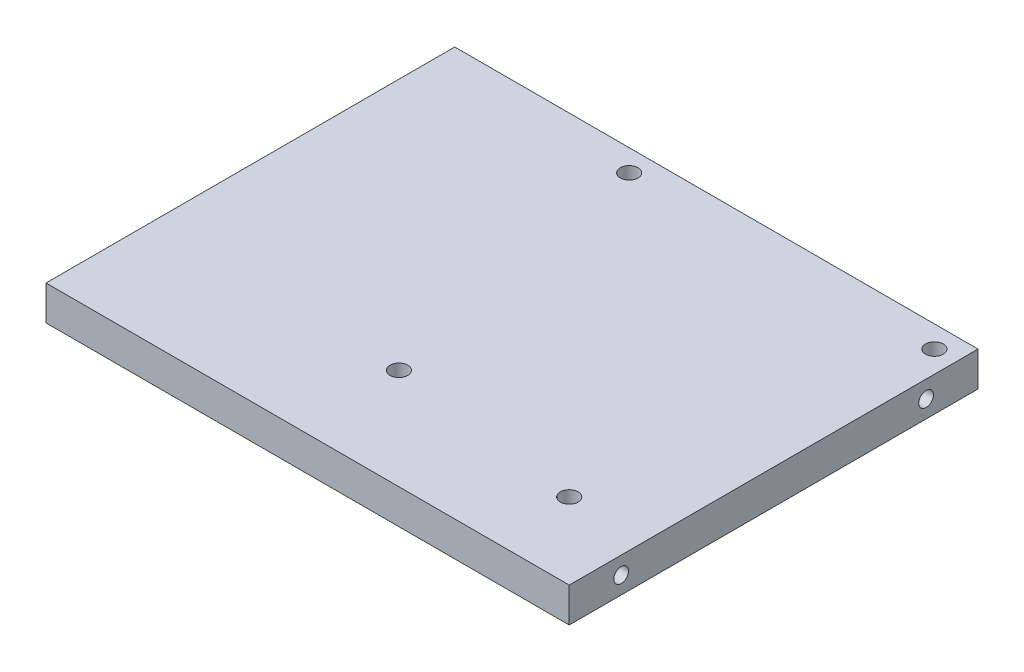
ISO-10303-21;
HEADER;
FILE_DESCRIPTION(('STEP AP214'),'2;1');
FILE_NAME('part.step','',(''),(''),'','','');
FILE_SCHEMA(('AUTOMOTIVE_DESIGN { 1 0 10303 214 1 1 1 1 }'));
ENDSEC;
DATA;
#1=APPLICATION_CONTEXT('core data for automotive mechanical design processes');
#2=APPLICATION_PROTOCOL_DEFINITION('international standard','automotive_design',2000,#1);
#3=PRODUCT_CONTEXT('',#1,'mechanical');
#4=PRODUCT('Part','Part','',(#3));
#5=PRODUCT_RELATED_PRODUCT_CATEGORY('part','',(#4));
#6=PRODUCT_DEFINITION_FORMATION('','',#4);
#7=PRODUCT_DEFINITION_CONTEXT('part definition',#1,'design');
#8=PRODUCT_DEFINITION('design','',#6,#7);
#9=PRODUCT_DEFINITION_SHAPE('','',#8);
#10=(LENGTH_UNIT() NAMED_UNIT(*) SI_UNIT(.MILLI.,.METRE.));
#11=(NAMED_UNIT(*) PLANE_ANGLE_UNIT() SI_UNIT($,.RADIAN.));
#12=(NAMED_UNIT(*) SI_UNIT($,.STERADIAN.) SOLID_ANGLE_UNIT());
#13=UNCERTAINTY_MEASURE_WITH_UNIT(LENGTH_MEASURE(1.E-05),#10,'distance_accuracy_value','');
#14=(GEOMETRIC_REPRESENTATION_CONTEXT(3) GLOBAL_UNCERTAINTY_ASSIGNED_CONTEXT((#13)) GLOBAL_UNIT_ASSIGNED_CONTEXT((#10,
#11,#12)) REPRESENTATION_CONTEXT('',''));
#15=CARTESIAN_POINT('',(0.,0.,0.));
#16=DIRECTION('',(0.,0.,1.));
#17=DIRECTION('',(1.,0.,0.));
#18=AXIS2_PLACEMENT_3D('',#15,#16,#17);
#19=CARTESIAN_POINT('',(0.,-1.65,0.));
#20=DIRECTION('',(-1.,0.,0.));
#21=DIRECTION('',(0.,0.,1.));
#22=AXIS2_PLACEMENT_3D('',#19,#20,#21);
#23=PLANE('',#22);
#24=CARTESIAN_POINT('',(0.,-4.82499999999987,-9.52499999999894));
#25=DIRECTION('',(-1.,0.,0.));
#26=DIRECTION('',(0.,0.,1.));
#27=AXIS2_PLACEMENT_3D('',#24,#25,#26);
#28=CIRCLE('',#27,1.35255);
#29=CARTESIAN_POINT('',(0.,-4.82499999999987,-8.17244999999894));
#30=VERTEX_POINT('',#29);
#31=EDGE_CURVE('E195',#30,#30,#28,.T.);
#32=ORIENTED_EDGE('',*,*,#31,.F.);
#33=EDGE_LOOP('',(#32));
#34=FACE_BOUND('',#33,.T.);
#35=CARTESIAN_POINT('',(-6.85272151523797E-13,-4.82499999999909,-65.4749999999989));
#36=DIRECTION('',(-1.,0.,0.));
#37=DIRECTION('',(0.,0.,1.));
#38=AXIS2_PLACEMENT_3D('',#35,#36,#37);
#39=CIRCLE('',#38,1.35255);
#40=CARTESIAN_POINT('',(-6.71116140091288E-13,-4.82499999999909,-64.1224499999989));
#41=VERTEX_POINT('',#40);
#42=EDGE_CURVE('E200',#41,#41,#39,.T.);
#43=ORIENTED_EDGE('',*,*,#42,.F.);
#44=EDGE_LOOP('',(#43));
#45=FACE_BOUND('',#44,.T.);
#46=DIRECTION('',(0.,0.,-1.));
#47=VECTOR('',#46,1.);
#48=CARTESIAN_POINT('',(0.,-8.,1.13028510162483E-13));
#49=LINE('',#48,#47);
#50=CARTESIAN_POINT('',(0.,-8.,1.13028510162483E-13));
#51=VERTEX_POINT('',#50);
#52=CARTESIAN_POINT('',(-7.84962372879504E-13,-8.00000000000105,-74.9999999999998));
#53=VERTEX_POINT('',#52);
#54=EDGE_CURVE('E98',#51,#53,#49,.T.);
#55=ORIENTED_EDGE('',*,*,#54,.F.);
#56=DIRECTION('',(0.,-1.,0.));
#57=VECTOR('',#56,1.);
#58=CARTESIAN_POINT('',(0.,-1.65,0.));
#59=LINE('',#58,#57);
#60=CARTESIAN_POINT('',(0.,-1.65,0.));
#61=VERTEX_POINT('',#60);
#62=EDGE_CURVE('E11',#61,#51,#59,.T.);
#63=ORIENTED_EDGE('',*,*,#62,.F.);
#64=DIRECTION('',(0.,0.,-1.));
#65=VECTOR('',#64,1.);
#66=CARTESIAN_POINT('',(0.,-1.65,0.));
#67=LINE('',#66,#65);
#68=CARTESIAN_POINT('',(-7.84962372879505E-13,-1.65000000000105,-74.9999999999999));
#69=VERTEX_POINT('',#68);
#70=EDGE_CURVE('E91',#61,#69,#67,.T.);
#71=ORIENTED_EDGE('',*,*,#70,.T.);
#72=DIRECTION('',(0.,-1.,0.));
#73=VECTOR('',#72,1.);
#74=CARTESIAN_POINT('',(-7.84962372879505E-13,-1.65000000000105,-74.9999999999999));
#75=LINE('',#74,#73);
#76=EDGE_CURVE('E36',#69,#53,#75,.T.);
#77=ORIENTED_EDGE('',*,*,#76,.T.);
#78=EDGE_LOOP('',(#55,#63,#71,#77));
#79=FACE_BOUND('',#78,.T.);
#80=ADVANCED_FACE('F33',(#34,#45,#79),#23,.T.);
#81=CARTESIAN_POINT('',(0.,-1.65,0.));
#82=DIRECTION('',(0.,0.,1.));
#83=DIRECTION('',(0.,-1.,0.));
#84=AXIS2_PLACEMENT_3D('',#81,#82,#83);
#85=PLANE('',#84);
#86=DIRECTION('',(-1.,0.,0.));
#87=VECTOR('',#86,1.);
#88=CARTESIAN_POINT('',(0.,-8.,1.13028510162483E-13));
#89=LINE('',#88,#87);
#90=CARTESIAN_POINT('',(96.,-8.,1.36623624645095E-13));
#91=VERTEX_POINT('',#90);
#92=EDGE_CURVE('E93',#91,#51,#89,.T.);
#93=ORIENTED_EDGE('',*,*,#92,.F.);
#94=DIRECTION('',(0.,-1.,0.));
#95=VECTOR('',#94,1.);
#96=CARTESIAN_POINT('',(96.,-1.65,0.));
#97=LINE('',#96,#95);
#98=CARTESIAN_POINT('',(96.,-1.65,0.));
#99=VERTEX_POINT('',#98);
#100=EDGE_CURVE('E42',#99,#91,#97,.T.);
#101=ORIENTED_EDGE('',*,*,#100,.F.);
#102=DIRECTION('',(-1.,0.,0.));
#103=VECTOR('',#102,1.);
#104=CARTESIAN_POINT('',(0.,-1.65,0.));
#105=LINE('',#104,#103);
#106=EDGE_CURVE('E88',#99,#61,#105,.T.);
#107=ORIENTED_EDGE('',*,*,#106,.T.);
#108=ORIENTED_EDGE('',*,*,#62,.T.);
#109=EDGE_LOOP('',(#93,#101,#107,#108));
#110=FACE_BOUND('',#109,.T.);
#111=ADVANCED_FACE('F109',(#110),#85,.T.);
#112=CARTESIAN_POINT('',(96.,-1.65,0.));
#113=DIRECTION('',(1.,0.,0.));
#114=DIRECTION('',(0.,1.,0.));
#115=AXIS2_PLACEMENT_3D('',#112,#113,#114);
#116=PLANE('',#115);
#117=CARTESIAN_POINT('',(96.,-4.825,-9.5249999999999));
#118=DIRECTION('',(1.,0.,0.));
#119=DIRECTION('',(0.,1.,0.));
#120=AXIS2_PLACEMENT_3D('',#117,#118,#119);
#121=CIRCLE('',#120,1.35255);
#122=CARTESIAN_POINT('',(96.,-3.47245,-9.5249999999999));
#123=VERTEX_POINT('',#122);
#124=EDGE_CURVE('E186',#123,#123,#121,.T.);
#125=ORIENTED_EDGE('',*,*,#124,.F.);
#126=EDGE_LOOP('',(#125));
#127=FACE_BOUND('',#126,.T.);
#128=CARTESIAN_POINT('',(96.,-4.825,-65.4749999999999));
#129=DIRECTION('',(1.,0.,0.));
#130=DIRECTION('',(0.,1.,0.));
#131=AXIS2_PLACEMENT_3D('',#128,#129,#130);
#132=CIRCLE('',#131,1.35255);
#133=CARTESIAN_POINT('',(96.,-3.47245,-65.4749999999999));
#134=VERTEX_POINT('',#133);
#135=EDGE_CURVE('E185',#134,#134,#132,.T.);
#136=ORIENTED_EDGE('',*,*,#135,.F.);
#137=EDGE_LOOP('',(#136));
#138=FACE_BOUND('',#137,.T.);
#139=DIRECTION('',(0.,0.,1.));
#140=VECTOR('',#139,1.);
#141=CARTESIAN_POINT('',(96.,-8.,1.36623624645095E-13));
#142=LINE('',#141,#140);
#143=CARTESIAN_POINT('',(96.,-8.00000000000105,-74.9999999999998));
#144=VERTEX_POINT('',#143);
#145=EDGE_CURVE('E83',#144,#91,#142,.T.);
#146=ORIENTED_EDGE('',*,*,#145,.F.);
#147=DIRECTION('',(0.,-1.,0.));
#148=VECTOR('',#147,1.);
#149=CARTESIAN_POINT('',(96.,-1.65000000000105,-74.9999999999999));
#150=LINE('',#149,#148);
#151=CARTESIAN_POINT('',(96.,-1.65000000000105,-74.9999999999999));
#152=VERTEX_POINT('',#151);
#153=EDGE_CURVE('E78',#152,#144,#150,.T.);
#154=ORIENTED_EDGE('',*,*,#153,.F.);
#155=DIRECTION('',(0.,0.,1.));
#156=VECTOR('',#155,1.);
#157=CARTESIAN_POINT('',(96.,-1.65,0.));
#158=LINE('',#157,#156);
#159=EDGE_CURVE('E81',#152,#99,#158,.T.);
#160=ORIENTED_EDGE('',*,*,#159,.T.);
#161=ORIENTED_EDGE('',*,*,#100,.T.);
#162=EDGE_LOOP('',(#146,#154,#160,#161));
#163=FACE_BOUND('',#162,.T.);
#164=ADVANCED_FACE('F80',(#127,#138,#163),#116,.T.);
#165=CARTESIAN_POINT('',(-7.84962372879505E-13,-1.65000000000105,-74.9999999999999));
#166=DIRECTION('',(0.,0.,-1.));
#167=DIRECTION('',(0.,1.,0.));
#168=AXIS2_PLACEMENT_3D('',#165,#166,#167);
#169=PLANE('',#168);
#170=DIRECTION('',(1.,0.,0.));
#171=VECTOR('',#170,1.);
#172=CARTESIAN_POINT('',(-7.84962372879504E-13,-8.00000000000105,-74.9999999999998));
#173=LINE('',#172,#171);
#174=EDGE_CURVE('E101',#53,#144,#173,.T.);
#175=ORIENTED_EDGE('',*,*,#174,.F.);
#176=ORIENTED_EDGE('',*,*,#76,.F.);
#177=DIRECTION('',(1.,0.,0.));
#178=VECTOR('',#177,1.);
#179=CARTESIAN_POINT('',(-7.84962372879505E-13,-1.65000000000105,-74.9999999999999));
#180=LINE('',#179,#178);
#181=EDGE_CURVE('E87',#69,#152,#180,.T.);
#182=ORIENTED_EDGE('',*,*,#181,.T.);
#183=ORIENTED_EDGE('',*,*,#153,.T.);
#184=EDGE_LOOP('',(#175,#176,#182,#183));
#185=FACE_BOUND('',#184,.T.);
#186=ADVANCED_FACE('F90',(#185),#169,.T.);
#187=CARTESIAN_POINT('',(0.,-1.65,0.));
#188=DIRECTION('',(0.,-1.,0.));
#189=DIRECTION('',(0.,0.,-1.));
#190=AXIS2_PLACEMENT_3D('',#187,#188,#189);
#191=PLANE('',#190);
#192=CARTESIAN_POINT('',(92.0000000000008,-1.65000000000099,-71.0000000000002));
#193=DIRECTION('',(0.,-1.,0.));
#194=DIRECTION('',(0.,0.,-1.));
#195=AXIS2_PLACEMENT_3D('',#192,#193,#194);
#196=CIRCLE('',#195,1.63194999999999);
#197=CARTESIAN_POINT('',(92.0000000000008,-1.65000000000102,-72.6319500000002));
#198=VERTEX_POINT('',#197);
#199=EDGE_CURVE('E209',#198,#198,#196,.T.);
#200=ORIENTED_EDGE('',*,*,#199,.T.);
#201=EDGE_LOOP('',(#200));
#202=FACE_BOUND('',#201,.T.);
#203=CARTESIAN_POINT('',(82.0000000000008,-1.6500000000002,-14.0000000000002));
#204=DIRECTION('',(0.,-1.,0.));
#205=DIRECTION('',(0.,0.,-1.));
#206=AXIS2_PLACEMENT_3D('',#203,#204,#205);
#207=CIRCLE('',#206,1.63195);
#208=CARTESIAN_POINT('',(82.0000000000008,-1.65000000000022,-15.6319500000002));
#209=VERTEX_POINT('',#208);
#210=EDGE_CURVE('E214',#209,#209,#207,.T.);
#211=ORIENTED_EDGE('',*,*,#210,.T.);
#212=EDGE_LOOP('',(#211));
#213=FACE_BOUND('',#212,.T.);
#214=CARTESIAN_POINT('',(46.2500000000008,-1.65000000000026,-18.5000000000002));
#215=DIRECTION('',(0.,-1.,0.));
#216=DIRECTION('',(0.,0.,-1.));
#217=AXIS2_PLACEMENT_3D('',#214,#215,#216);
#218=CIRCLE('',#217,1.63195);
#219=CARTESIAN_POINT('',(46.2500000000008,-1.65000000000028,-20.1319500000002));
#220=VERTEX_POINT('',#219);
#221=EDGE_CURVE('E220',#220,#220,#218,.T.);
#222=ORIENTED_EDGE('',*,*,#221,.T.);
#223=EDGE_LOOP('',(#222));
#224=FACE_BOUND('',#223,.T.);
#225=CARTESIAN_POINT('',(36.0000000000008,-1.65000000000099,-71.0000000000002));
#226=DIRECTION('',(0.,-1.,0.));
#227=DIRECTION('',(0.,0.,-1.));
#228=AXIS2_PLACEMENT_3D('',#225,#226,#227);
#229=CIRCLE('',#228,1.63195);
#230=CARTESIAN_POINT('',(36.0000000000008,-1.65000000000102,-72.6319500000002));
#231=VERTEX_POINT('',#230);
#232=EDGE_CURVE('E102',#231,#231,#229,.T.);
#233=ORIENTED_EDGE('',*,*,#232,.T.);
#234=EDGE_LOOP('',(#233));
#235=FACE_BOUND('',#234,.T.);
#236=ORIENTED_EDGE('',*,*,#70,.F.);
#237=ORIENTED_EDGE('',*,*,#106,.F.);
#238=ORIENTED_EDGE('',*,*,#159,.F.);
#239=ORIENTED_EDGE('',*,*,#181,.F.);
#240=EDGE_LOOP('',(#236,#237,#238,#239));
#241=FACE_BOUND('',#240,.T.);
#242=ADVANCED_FACE('F86',(#202,#213,#224,#235,#241),#191,.F.);
#243=CARTESIAN_POINT('',(0.,-8.,1.11762451145599E-13));
#244=DIRECTION('',(0.,-1.,0.));
#245=DIRECTION('',(0.,0.,-1.));
#246=AXIS2_PLACEMENT_3D('',#243,#244,#245);
#247=PLANE('',#246);
#248=CARTESIAN_POINT('',(92.0000000000008,-8.00000000000099,-71.0000000000001));
#249=DIRECTION('',(0.,-1.,0.));
#250=DIRECTION('',(0.,0.,-1.));
#251=AXIS2_PLACEMENT_3D('',#248,#249,#250);
#252=CIRCLE('',#251,1.63194999999999);
#253=CARTESIAN_POINT('',(92.0000000000008,-8.00000000000101,-72.6319500000001));
#254=VERTEX_POINT('',#253);
#255=EDGE_CURVE('E206',#254,#254,#252,.T.);
#256=ORIENTED_EDGE('',*,*,#255,.F.);
#257=EDGE_LOOP('',(#256));
#258=FACE_BOUND('',#257,.T.);
#259=CARTESIAN_POINT('',(82.0000000000008,-8.0000000000002,-14.0000000000001));
#260=DIRECTION('',(0.,-1.,0.));
#261=DIRECTION('',(0.,0.,-1.));
#262=AXIS2_PLACEMENT_3D('',#259,#260,#261);
#263=CIRCLE('',#262,1.63195);
#264=CARTESIAN_POINT('',(82.0000000000008,-8.00000000000022,-15.6319500000001));
#265=VERTEX_POINT('',#264);
#266=EDGE_CURVE('E211',#265,#265,#263,.T.);
#267=ORIENTED_EDGE('',*,*,#266,.F.);
#268=EDGE_LOOP('',(#267));
#269=FACE_BOUND('',#268,.T.);
#270=CARTESIAN_POINT('',(46.2500000000008,-8.00000000000026,-18.5000000000001));
#271=DIRECTION('',(0.,-1.,0.));
#272=DIRECTION('',(0.,0.,-1.));
#273=AXIS2_PLACEMENT_3D('',#270,#271,#272);
#274=CIRCLE('',#273,1.63195);
#275=CARTESIAN_POINT('',(46.2500000000008,-8.00000000000028,-20.1319500000001));
#276=VERTEX_POINT('',#275);
#277=EDGE_CURVE('E217',#276,#276,#274,.T.);
#278=ORIENTED_EDGE('',*,*,#277,.F.);
#279=EDGE_LOOP('',(#278));
#280=FACE_BOUND('',#279,.T.);
#281=CARTESIAN_POINT('',(36.0000000000008,-8.00000000000099,-71.0000000000001));
#282=DIRECTION('',(0.,-1.,0.));
#283=DIRECTION('',(0.,0.,-1.));
#284=AXIS2_PLACEMENT_3D('',#281,#282,#283);
#285=CIRCLE('',#284,1.63195);
#286=CARTESIAN_POINT('',(36.0000000000008,-8.00000000000101,-72.6319500000001));
#287=VERTEX_POINT('',#286);
#288=EDGE_CURVE('E223',#287,#287,#285,.T.);
#289=ORIENTED_EDGE('',*,*,#288,.F.);
#290=EDGE_LOOP('',(#289));
#291=FACE_BOUND('',#290,.T.);
#292=ORIENTED_EDGE('',*,*,#54,.T.);
#293=ORIENTED_EDGE('',*,*,#174,.T.);
#294=ORIENTED_EDGE('',*,*,#145,.T.);
#295=ORIENTED_EDGE('',*,*,#92,.T.);
#296=EDGE_LOOP('',(#292,#293,#294,#295));
#297=FACE_BOUND('',#296,.T.);
#298=ADVANCED_FACE('F108',(#258,#269,#280,#291,#297),#247,.T.);
#299=CARTESIAN_POINT('',(36.0000000000008,-1.65000000000099,-71.0000000000002));
#300=DIRECTION('',(0.,-1.,0.));
#301=DIRECTION('',(0.,0.,-1.));
#302=AXIS2_PLACEMENT_3D('',#299,#300,#301);
#303=CYLINDRICAL_SURFACE('',#302,1.63195);
#304=ORIENTED_EDGE('',*,*,#232,.F.);
#305=EDGE_LOOP('',(#304));
#306=FACE_BOUND('',#305,.T.);
#307=ORIENTED_EDGE('',*,*,#288,.T.);
#308=EDGE_LOOP('',(#307));
#309=FACE_BOUND('',#308,.T.);
#310=ADVANCED_FACE('F129',(#306,#309),#303,.F.);
#311=CARTESIAN_POINT('',(46.2500000000008,-1.65000000000026,-18.5000000000002));
#312=DIRECTION('',(0.,-1.,0.));
#313=DIRECTION('',(0.,0.,-1.));
#314=AXIS2_PLACEMENT_3D('',#311,#312,#313);
#315=CYLINDRICAL_SURFACE('',#314,1.63195);
#316=ORIENTED_EDGE('',*,*,#221,.F.);
#317=EDGE_LOOP('',(#316));
#318=FACE_BOUND('',#317,.T.);
#319=ORIENTED_EDGE('',*,*,#277,.T.);
#320=EDGE_LOOP('',(#319));
#321=FACE_BOUND('',#320,.T.);
#322=ADVANCED_FACE('F136',(#318,#321),#315,.F.);
#323=CARTESIAN_POINT('',(82.0000000000008,-1.6500000000002,-14.0000000000002));
#324=DIRECTION('',(0.,-1.,0.));
#325=DIRECTION('',(0.,0.,-1.));
#326=AXIS2_PLACEMENT_3D('',#323,#324,#325);
#327=CYLINDRICAL_SURFACE('',#326,1.63195);
#328=ORIENTED_EDGE('',*,*,#210,.F.);
#329=EDGE_LOOP('',(#328));
#330=FACE_BOUND('',#329,.T.);
#331=ORIENTED_EDGE('',*,*,#266,.T.);
#332=EDGE_LOOP('',(#331));
#333=FACE_BOUND('',#332,.T.);
#334=ADVANCED_FACE('F140',(#330,#333),#327,.F.);
#335=CARTESIAN_POINT('',(92.0000000000008,-1.65000000000099,-71.0000000000002));
#336=DIRECTION('',(0.,-1.,0.));
#337=DIRECTION('',(0.,0.,-1.));
#338=AXIS2_PLACEMENT_3D('',#335,#336,#337);
#339=CYLINDRICAL_SURFACE('',#338,1.63194999999999);
#340=ORIENTED_EDGE('',*,*,#199,.F.);
#341=EDGE_LOOP('',(#340));
#342=FACE_BOUND('',#341,.T.);
#343=ORIENTED_EDGE('',*,*,#255,.T.);
#344=EDGE_LOOP('',(#343));
#345=FACE_BOUND('',#344,.T.);
#346=ADVANCED_FACE('F144',(#342,#345),#339,.F.);
#347=CARTESIAN_POINT('',(9.52499999999931,-4.82499999999909,-65.474999999999));
#348=DIRECTION('',(-1.,0.,0.));
#349=DIRECTION('',(0.,0.,1.));
#350=AXIS2_PLACEMENT_3D('',#347,#348,#349);
#351=CYLINDRICAL_SURFACE('',#350,1.35255);
#352=CARTESIAN_POINT('',(9.52499999999931,-4.82499999999909,-65.474999999999));
#353=DIRECTION('',(-1.,0.,0.));
#354=DIRECTION('',(0.,0.,1.));
#355=AXIS2_PLACEMENT_3D('',#352,#353,#354);
#356=CIRCLE('',#355,1.35255);
#357=CARTESIAN_POINT('',(9.52499999999933,-4.82499999999909,-64.122449999999));
#358=VERTEX_POINT('',#357);
#359=EDGE_CURVE('E203',#358,#358,#356,.T.);
#360=ORIENTED_EDGE('',*,*,#359,.F.);
#361=EDGE_LOOP('',(#360));
#362=FACE_BOUND('',#361,.T.);
#363=ORIENTED_EDGE('',*,*,#42,.T.);
#364=EDGE_LOOP('',(#363));
#365=FACE_BOUND('',#364,.T.);
#366=ADVANCED_FACE('F148',(#362,#365),#351,.F.);
#367=CARTESIAN_POINT('',(9.52499999999931,-4.82499999999909,-65.474999999999));
#368=DIRECTION('',(-1.,0.,0.));
#369=DIRECTION('',(0.,0.,1.));
#370=AXIS2_PLACEMENT_3D('',#367,#368,#369);
#371=PLANE('',#370);
#372=ORIENTED_EDGE('',*,*,#359,.T.);
#373=EDGE_LOOP('',(#372));
#374=FACE_BOUND('',#373,.T.);
#375=ADVANCED_FACE('F152',(#374),#371,.T.);
#376=CARTESIAN_POINT('',(9.5249999999999,-4.82499999999987,-9.52499999999904));
#377=DIRECTION('',(-1.,0.,0.));
#378=DIRECTION('',(0.,0.,1.));
#379=AXIS2_PLACEMENT_3D('',#376,#377,#378);
#380=CYLINDRICAL_SURFACE('',#379,1.35255);
#381=CARTESIAN_POINT('',(9.5249999999999,-4.82499999999987,-9.52499999999904));
#382=DIRECTION('',(-1.,0.,0.));
#383=DIRECTION('',(0.,0.,1.));
#384=AXIS2_PLACEMENT_3D('',#381,#382,#383);
#385=CIRCLE('',#384,1.35255);
#386=CARTESIAN_POINT('',(9.52499999999992,-4.82499999999987,-8.17244999999904));
#387=VERTEX_POINT('',#386);
#388=EDGE_CURVE('E197',#387,#387,#385,.T.);
#389=ORIENTED_EDGE('',*,*,#388,.F.);
#390=EDGE_LOOP('',(#389));
#391=FACE_BOUND('',#390,.T.);
#392=ORIENTED_EDGE('',*,*,#31,.T.);
#393=EDGE_LOOP('',(#392));
#394=FACE_BOUND('',#393,.T.);
#395=ADVANCED_FACE('F156',(#391,#394),#380,.F.);
#396=CARTESIAN_POINT('',(9.5249999999999,-4.82499999999987,-9.52499999999904));
#397=DIRECTION('',(-1.,0.,0.));
#398=DIRECTION('',(0.,0.,1.));
#399=AXIS2_PLACEMENT_3D('',#396,#397,#398);
#400=PLANE('',#399);
#401=ORIENTED_EDGE('',*,*,#388,.T.);
#402=EDGE_LOOP('',(#401));
#403=FACE_BOUND('',#402,.T.);
#404=ADVANCED_FACE('F160',(#403),#400,.T.);
#405=CARTESIAN_POINT('',(86.475,-4.825,-65.4749999999999));
#406=DIRECTION('',(1.,0.,0.));
#407=DIRECTION('',(0.,1.,0.));
#408=AXIS2_PLACEMENT_3D('',#405,#406,#407);
#409=CYLINDRICAL_SURFACE('',#408,1.35255);
#410=CARTESIAN_POINT('',(86.475,-4.825,-65.4749999999999));
#411=DIRECTION('',(1.,0.,0.));
#412=DIRECTION('',(0.,1.,0.));
#413=AXIS2_PLACEMENT_3D('',#410,#411,#412);
#414=CIRCLE('',#413,1.35255);
#415=CARTESIAN_POINT('',(86.475,-3.47245,-65.4749999999999));
#416=VERTEX_POINT('',#415);
#417=EDGE_CURVE('E189',#416,#416,#414,.T.);
#418=ORIENTED_EDGE('',*,*,#417,.F.);
#419=EDGE_LOOP('',(#418));
#420=FACE_BOUND('',#419,.T.);
#421=ORIENTED_EDGE('',*,*,#135,.T.);
#422=EDGE_LOOP('',(#421));
#423=FACE_BOUND('',#422,.T.);
#424=ADVANCED_FACE('F164',(#420,#423),#409,.F.);
#425=CARTESIAN_POINT('',(86.475,-4.825,-65.4749999999999));
#426=DIRECTION('',(1.,0.,0.));
#427=DIRECTION('',(0.,1.,0.));
#428=AXIS2_PLACEMENT_3D('',#425,#426,#427);
#429=PLANE('',#428);
#430=ORIENTED_EDGE('',*,*,#417,.T.);
#431=EDGE_LOOP('',(#430));
#432=FACE_BOUND('',#431,.T.);
#433=ADVANCED_FACE('F168',(#432),#429,.T.);
#434=CARTESIAN_POINT('',(86.475,-4.825,-9.5249999999999));
#435=DIRECTION('',(1.,0.,0.));
#436=DIRECTION('',(0.,1.,0.));
#437=AXIS2_PLACEMENT_3D('',#434,#435,#436);
#438=CYLINDRICAL_SURFACE('',#437,1.35255);
#439=CARTESIAN_POINT('',(86.475,-4.825,-9.5249999999999));
#440=DIRECTION('',(1.,0.,0.));
#441=DIRECTION('',(0.,1.,0.));
#442=AXIS2_PLACEMENT_3D('',#439,#440,#441);
#443=CIRCLE('',#442,1.35255);
#444=CARTESIAN_POINT('',(86.475,-3.47245,-9.5249999999999));
#445=VERTEX_POINT('',#444);
#446=EDGE_CURVE('E184',#445,#445,#443,.T.);
#447=ORIENTED_EDGE('',*,*,#446,.F.);
#448=EDGE_LOOP('',(#447));
#449=FACE_BOUND('',#448,.T.);
#450=ORIENTED_EDGE('',*,*,#124,.T.);
#451=EDGE_LOOP('',(#450));
#452=FACE_BOUND('',#451,.T.);
#453=ADVANCED_FACE('F172',(#449,#452),#438,.F.);
#454=CARTESIAN_POINT('',(86.475,-4.825,-9.5249999999999));
#455=DIRECTION('',(1.,0.,0.));
#456=DIRECTION('',(0.,1.,0.));
#457=AXIS2_PLACEMENT_3D('',#454,#455,#456);
#458=PLANE('',#457);
#459=ORIENTED_EDGE('',*,*,#446,.T.);
#460=EDGE_LOOP('',(#459));
#461=FACE_BOUND('',#460,.T.);
#462=ADVANCED_FACE('F176',(#461),#458,.T.);
#463=CLOSED_SHELL('',(#80,#111,#164,#186,#242,#298,#310,#322,#334,#346,#366,#375,#395,#404,#424,
#433,#453,#462));
#464=MANIFOLD_SOLID_BREP('B2',#463);
#465=ADVANCED_BREP_SHAPE_REPRESENTATION('',(#18,#464),#14);
#466=SHAPE_DEFINITION_REPRESENTATION(#9,#465);
ENDSEC;
END-ISO-10303-21;
